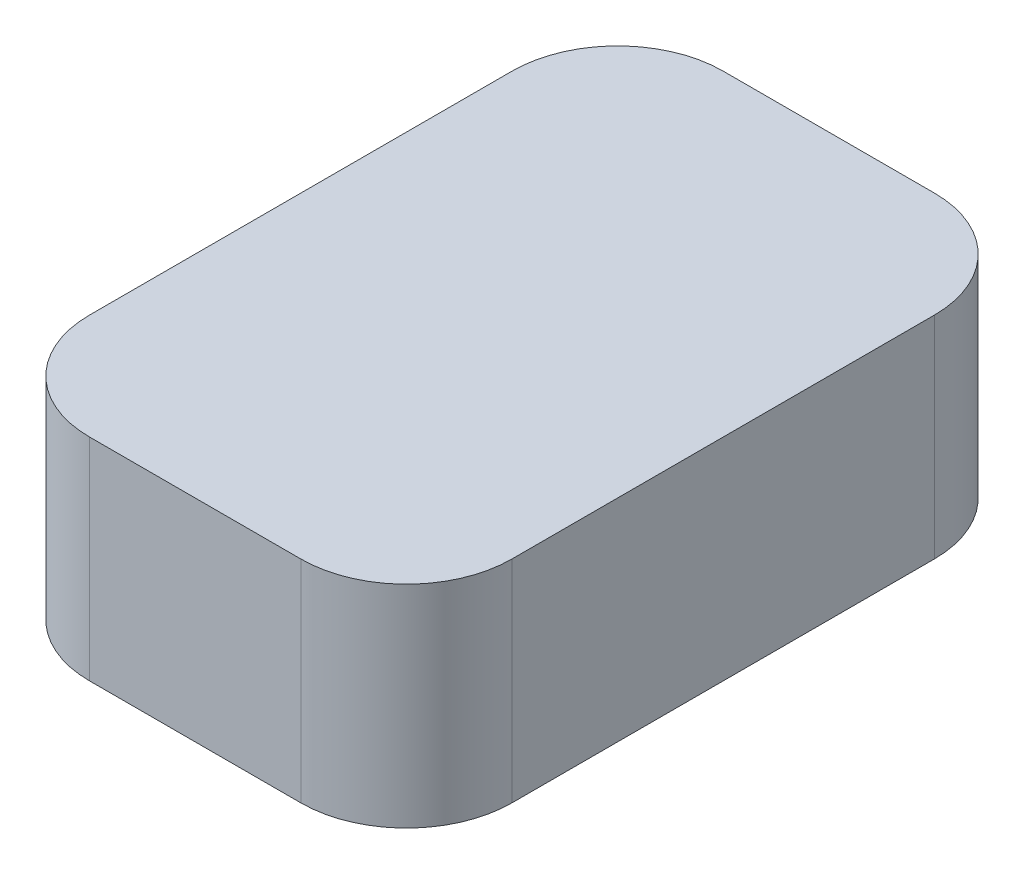
ISO-10303-21;
HEADER;
FILE_DESCRIPTION(('STEP AP214'),'2;1');
FILE_NAME('part.step','',(''),(''),'','','');
FILE_SCHEMA(('AUTOMOTIVE_DESIGN { 1 0 10303 214 1 1 1 1 }'));
ENDSEC;
DATA;
#1=APPLICATION_CONTEXT('core data for automotive mechanical design processes');
#2=APPLICATION_PROTOCOL_DEFINITION('international standard','automotive_design',2000,#1);
#3=PRODUCT_CONTEXT('',#1,'mechanical');
#4=PRODUCT('Part','Part','',(#3));
#5=PRODUCT_RELATED_PRODUCT_CATEGORY('part','',(#4));
#6=PRODUCT_DEFINITION_FORMATION('','',#4);
#7=PRODUCT_DEFINITION_CONTEXT('part definition',#1,'design');
#8=PRODUCT_DEFINITION('design','',#6,#7);
#9=PRODUCT_DEFINITION_SHAPE('','',#8);
#10=(LENGTH_UNIT() NAMED_UNIT(*) SI_UNIT(.MILLI.,.METRE.));
#11=(NAMED_UNIT(*) PLANE_ANGLE_UNIT() SI_UNIT($,.RADIAN.));
#12=(NAMED_UNIT(*) SI_UNIT($,.STERADIAN.) SOLID_ANGLE_UNIT());
#13=UNCERTAINTY_MEASURE_WITH_UNIT(LENGTH_MEASURE(1.E-05),#10,'distance_accuracy_value','');
#14=(GEOMETRIC_REPRESENTATION_CONTEXT(3) GLOBAL_UNCERTAINTY_ASSIGNED_CONTEXT((#13)) GLOBAL_UNIT_ASSIGNED_CONTEXT((#10,
#11,#12)) REPRESENTATION_CONTEXT('',''));
#15=CARTESIAN_POINT('',(0.,0.,0.));
#16=DIRECTION('',(0.,0.,1.));
#17=DIRECTION('',(1.,0.,0.));
#18=AXIS2_PLACEMENT_3D('',#15,#16,#17);
#19=CARTESIAN_POINT('',(10.,-10.,15.));
#20=DIRECTION('',(1.,0.,0.));
#21=DIRECTION('',(0.,0.,-1.));
#22=AXIS2_PLACEMENT_3D('',#19,#20,#21);
#23=PLANE('',#22);
#24=DIRECTION('',(0.,0.,-1.));
#25=VECTOR('',#24,1.);
#26=CARTESIAN_POINT('',(10.,-10.,15.));
#27=LINE('',#26,#25);
#28=CARTESIAN_POINT('',(10.,-10.,10.));
#29=VERTEX_POINT('',#28);
#30=CARTESIAN_POINT('',(10.,-10.,-10.));
#31=VERTEX_POINT('',#30);
#32=EDGE_CURVE('E167',#29,#31,#27,.T.);
#33=ORIENTED_EDGE('',*,*,#32,.T.);
#34=DIRECTION('',(0.,1.,0.));
#35=VECTOR('',#34,1.);
#36=CARTESIAN_POINT('',(10.,-10.,-10.));
#37=LINE('',#36,#35);
#38=CARTESIAN_POINT('',(10.,0.,-10.));
#39=VERTEX_POINT('',#38);
#40=EDGE_CURVE('E115',#31,#39,#37,.T.);
#41=ORIENTED_EDGE('',*,*,#40,.T.);
#42=DIRECTION('',(0.,0.,-1.));
#43=VECTOR('',#42,1.);
#44=CARTESIAN_POINT('',(10.,0.,15.));
#45=LINE('',#44,#43);
#46=CARTESIAN_POINT('',(10.,0.,10.));
#47=VERTEX_POINT('',#46);
#48=EDGE_CURVE('E107',#47,#39,#45,.T.);
#49=ORIENTED_EDGE('',*,*,#48,.F.);
#50=DIRECTION('',(0.,1.,0.));
#51=VECTOR('',#50,1.);
#52=CARTESIAN_POINT('',(10.,-10.,10.));
#53=LINE('',#52,#51);
#54=EDGE_CURVE('E120',#47,#29,#53,.F.);
#55=ORIENTED_EDGE('',*,*,#54,.T.);
#56=EDGE_LOOP('',(#33,#41,#49,#55));
#57=FACE_BOUND('',#56,.T.);
#58=ADVANCED_FACE('F38',(#57),#23,.T.);
#59=CARTESIAN_POINT('',(-10.,-10.,15.));
#60=DIRECTION('',(0.,0.,1.));
#61=DIRECTION('',(1.,0.,0.));
#62=AXIS2_PLACEMENT_3D('',#59,#60,#61);
#63=PLANE('',#62);
#64=DIRECTION('',(1.,0.,0.));
#65=VECTOR('',#64,1.);
#66=CARTESIAN_POINT('',(-10.,0.,15.));
#67=LINE('',#66,#65);
#68=CARTESIAN_POINT('',(-5.,0.,15.));
#69=VERTEX_POINT('',#68);
#70=CARTESIAN_POINT('',(5.,0.,15.));
#71=VERTEX_POINT('',#70);
#72=EDGE_CURVE('E109',#69,#71,#67,.T.);
#73=ORIENTED_EDGE('',*,*,#72,.F.);
#74=DIRECTION('',(0.,1.,0.));
#75=VECTOR('',#74,1.);
#76=CARTESIAN_POINT('',(-5.,-10.,15.));
#77=LINE('',#76,#75);
#78=CARTESIAN_POINT('',(-5.,-10.,15.));
#79=VERTEX_POINT('',#78);
#80=EDGE_CURVE('E11',#69,#79,#77,.F.);
#81=ORIENTED_EDGE('',*,*,#80,.T.);
#82=DIRECTION('',(1.,0.,0.));
#83=VECTOR('',#82,1.);
#84=CARTESIAN_POINT('',(-10.,-10.,15.));
#85=LINE('',#84,#83);
#86=CARTESIAN_POINT('',(5.,-10.,15.));
#87=VERTEX_POINT('',#86);
#88=EDGE_CURVE('E127',#79,#87,#85,.T.);
#89=ORIENTED_EDGE('',*,*,#88,.T.);
#90=DIRECTION('',(0.,1.,0.));
#91=VECTOR('',#90,1.);
#92=CARTESIAN_POINT('',(5.,-10.,15.));
#93=LINE('',#92,#91);
#94=EDGE_CURVE('E46',#87,#71,#93,.T.);
#95=ORIENTED_EDGE('',*,*,#94,.T.);
#96=EDGE_LOOP('',(#73,#81,#89,#95));
#97=FACE_BOUND('',#96,.T.);
#98=ADVANCED_FACE('F156',(#97),#63,.T.);
#99=CARTESIAN_POINT('',(-10.,-10.,15.));
#100=DIRECTION('',(-1.,0.,0.));
#101=DIRECTION('',(0.,0.,1.));
#102=AXIS2_PLACEMENT_3D('',#99,#100,#101);
#103=PLANE('',#102);
#104=DIRECTION('',(0.,0.,1.));
#105=VECTOR('',#104,1.);
#106=CARTESIAN_POINT('',(-10.,0.,15.));
#107=LINE('',#106,#105);
#108=CARTESIAN_POINT('',(-10.,0.,-10.));
#109=VERTEX_POINT('',#108);
#110=CARTESIAN_POINT('',(-10.,0.,10.));
#111=VERTEX_POINT('',#110);
#112=EDGE_CURVE('E165',#109,#111,#107,.T.);
#113=ORIENTED_EDGE('',*,*,#112,.F.);
#114=DIRECTION('',(0.,1.,0.));
#115=VECTOR('',#114,1.);
#116=CARTESIAN_POINT('',(-10.,-10.,-10.));
#117=LINE('',#116,#115);
#118=CARTESIAN_POINT('',(-10.,-10.,-10.));
#119=VERTEX_POINT('',#118);
#120=EDGE_CURVE('E60',#109,#119,#117,.F.);
#121=ORIENTED_EDGE('',*,*,#120,.T.);
#122=DIRECTION('',(0.,0.,1.));
#123=VECTOR('',#122,1.);
#124=CARTESIAN_POINT('',(-10.,-10.,15.));
#125=LINE('',#124,#123);
#126=CARTESIAN_POINT('',(-10.,-10.,10.));
#127=VERTEX_POINT('',#126);
#128=EDGE_CURVE('E131',#119,#127,#125,.T.);
#129=ORIENTED_EDGE('',*,*,#128,.T.);
#130=DIRECTION('',(0.,1.,0.));
#131=VECTOR('',#130,1.);
#132=CARTESIAN_POINT('',(-10.,-10.,10.));
#133=LINE('',#132,#131);
#134=EDGE_CURVE('E152',#127,#111,#133,.T.);
#135=ORIENTED_EDGE('',*,*,#134,.T.);
#136=EDGE_LOOP('',(#113,#121,#129,#135));
#137=FACE_BOUND('',#136,.T.);
#138=ADVANCED_FACE('F164',(#137),#103,.T.);
#139=CARTESIAN_POINT('',(-10.,-10.,-15.));
#140=DIRECTION('',(0.,0.,-1.));
#141=DIRECTION('',(-1.,0.,0.));
#142=AXIS2_PLACEMENT_3D('',#139,#140,#141);
#143=PLANE('',#142);
#144=DIRECTION('',(-1.,0.,0.));
#145=VECTOR('',#144,1.);
#146=CARTESIAN_POINT('',(-10.,0.,-15.));
#147=LINE('',#146,#145);
#148=CARTESIAN_POINT('',(5.,0.,-15.));
#149=VERTEX_POINT('',#148);
#150=CARTESIAN_POINT('',(-5.,0.,-15.));
#151=VERTEX_POINT('',#150);
#152=EDGE_CURVE('E123',#149,#151,#147,.T.);
#153=ORIENTED_EDGE('',*,*,#152,.F.);
#154=DIRECTION('',(0.,1.,0.));
#155=VECTOR('',#154,1.);
#156=CARTESIAN_POINT('',(5.,-10.,-15.));
#157=LINE('',#156,#155);
#158=CARTESIAN_POINT('',(5.,-10.,-15.));
#159=VERTEX_POINT('',#158);
#160=EDGE_CURVE('E144',#149,#159,#157,.F.);
#161=ORIENTED_EDGE('',*,*,#160,.T.);
#162=DIRECTION('',(-1.,0.,0.));
#163=VECTOR('',#162,1.);
#164=CARTESIAN_POINT('',(-10.,-10.,-15.));
#165=LINE('',#164,#163);
#166=CARTESIAN_POINT('',(-5.,-10.,-15.));
#167=VERTEX_POINT('',#166);
#168=EDGE_CURVE('E171',#159,#167,#165,.T.);
#169=ORIENTED_EDGE('',*,*,#168,.T.);
#170=DIRECTION('',(0.,1.,0.));
#171=VECTOR('',#170,1.);
#172=CARTESIAN_POINT('',(-5.,-10.,-15.));
#173=LINE('',#172,#171);
#174=EDGE_CURVE('E141',#167,#151,#173,.T.);
#175=ORIENTED_EDGE('',*,*,#174,.T.);
#176=EDGE_LOOP('',(#153,#161,#169,#175));
#177=FACE_BOUND('',#176,.T.);
#178=ADVANCED_FACE('F180',(#177),#143,.T.);
#179=CARTESIAN_POINT('',(0.,-10.,0.));
#180=DIRECTION('',(0.,-1.,0.));
#181=DIRECTION('',(0.,0.,-1.));
#182=AXIS2_PLACEMENT_3D('',#179,#180,#181);
#183=PLANE('',#182);
#184=ORIENTED_EDGE('',*,*,#168,.F.);
#185=CARTESIAN_POINT('',(5.,-10.,-10.));
#186=DIRECTION('',(0.,-1.,0.));
#187=DIRECTION('',(0.,0.,-1.));
#188=AXIS2_PLACEMENT_3D('',#185,#186,#187);
#189=CIRCLE('',#188,5.);
#190=EDGE_CURVE('E150',#159,#31,#189,.T.);
#191=ORIENTED_EDGE('',*,*,#190,.T.);
#192=ORIENTED_EDGE('',*,*,#32,.F.);
#193=CARTESIAN_POINT('',(5.,-10.,10.));
#194=DIRECTION('',(0.,-1.,0.));
#195=DIRECTION('',(0.,0.,-1.));
#196=AXIS2_PLACEMENT_3D('',#193,#194,#195);
#197=CIRCLE('',#196,5.);
#198=EDGE_CURVE('E126',#29,#87,#197,.T.);
#199=ORIENTED_EDGE('',*,*,#198,.T.);
#200=ORIENTED_EDGE('',*,*,#88,.F.);
#201=CARTESIAN_POINT('',(-5.,-10.,10.));
#202=DIRECTION('',(0.,-1.,0.));
#203=DIRECTION('',(0.,0.,-1.));
#204=AXIS2_PLACEMENT_3D('',#201,#202,#203);
#205=CIRCLE('',#204,5.);
#206=EDGE_CURVE('E53',#79,#127,#205,.T.);
#207=ORIENTED_EDGE('',*,*,#206,.T.);
#208=ORIENTED_EDGE('',*,*,#128,.F.);
#209=CARTESIAN_POINT('',(-5.,-10.,-10.));
#210=DIRECTION('',(0.,-1.,0.));
#211=DIRECTION('',(0.,0.,-1.));
#212=AXIS2_PLACEMENT_3D('',#209,#210,#211);
#213=CIRCLE('',#212,5.);
#214=EDGE_CURVE('E148',#119,#167,#213,.T.);
#215=ORIENTED_EDGE('',*,*,#214,.T.);
#216=EDGE_LOOP('',(#184,#191,#192,#199,#200,#207,#208,#215));
#217=FACE_BOUND('',#216,.T.);
#218=ADVANCED_FACE('F159',(#217),#183,.T.);
#219=CARTESIAN_POINT('',(0.,0.,0.));
#220=DIRECTION('',(0.,-1.,0.));
#221=DIRECTION('',(0.,0.,-1.));
#222=AXIS2_PLACEMENT_3D('',#219,#220,#221);
#223=PLANE('',#222);
#224=ORIENTED_EDGE('',*,*,#48,.T.);
#225=CARTESIAN_POINT('',(5.,0.,-10.));
#226=DIRECTION('',(0.,-1.,0.));
#227=DIRECTION('',(0.,0.,-1.));
#228=AXIS2_PLACEMENT_3D('',#225,#226,#227);
#229=CIRCLE('',#228,5.);
#230=EDGE_CURVE('E139',#39,#149,#229,.F.);
#231=ORIENTED_EDGE('',*,*,#230,.T.);
#232=ORIENTED_EDGE('',*,*,#152,.T.);
#233=CARTESIAN_POINT('',(-5.,0.,-10.));
#234=DIRECTION('',(0.,-1.,0.));
#235=DIRECTION('',(0.,0.,-1.));
#236=AXIS2_PLACEMENT_3D('',#233,#234,#235);
#237=CIRCLE('',#236,5.);
#238=EDGE_CURVE('E137',#151,#109,#237,.F.);
#239=ORIENTED_EDGE('',*,*,#238,.T.);
#240=ORIENTED_EDGE('',*,*,#112,.T.);
#241=CARTESIAN_POINT('',(-5.,0.,10.));
#242=DIRECTION('',(0.,-1.,0.));
#243=DIRECTION('',(0.,0.,-1.));
#244=AXIS2_PLACEMENT_3D('',#241,#242,#243);
#245=CIRCLE('',#244,5.);
#246=EDGE_CURVE('E114',#111,#69,#245,.F.);
#247=ORIENTED_EDGE('',*,*,#246,.T.);
#248=ORIENTED_EDGE('',*,*,#72,.T.);
#249=CARTESIAN_POINT('',(5.,0.,10.));
#250=DIRECTION('',(0.,-1.,0.));
#251=DIRECTION('',(0.,0.,-1.));
#252=AXIS2_PLACEMENT_3D('',#249,#250,#251);
#253=CIRCLE('',#252,5.);
#254=EDGE_CURVE('E104',#71,#47,#253,.F.);
#255=ORIENTED_EDGE('',*,*,#254,.T.);
#256=EDGE_LOOP('',(#224,#231,#232,#239,#240,#247,#248,#255));
#257=FACE_BOUND('',#256,.T.);
#258=ADVANCED_FACE('F106',(#257),#223,.F.);
#259=CARTESIAN_POINT('',(5.,-10.,-10.));
#260=DIRECTION('',(0.,1.,0.));
#261=DIRECTION('',(0.,0.,1.));
#262=AXIS2_PLACEMENT_3D('',#259,#260,#261);
#263=CYLINDRICAL_SURFACE('',#262,5.);
#264=ORIENTED_EDGE('',*,*,#190,.F.);
#265=ORIENTED_EDGE('',*,*,#160,.F.);
#266=ORIENTED_EDGE('',*,*,#230,.F.);
#267=ORIENTED_EDGE('',*,*,#40,.F.);
#268=EDGE_LOOP('',(#264,#265,#266,#267));
#269=FACE_BOUND('',#268,.T.);
#270=ADVANCED_FACE('F176',(#269),#263,.T.);
#271=CARTESIAN_POINT('',(-5.,-10.,-10.));
#272=DIRECTION('',(0.,1.,0.));
#273=DIRECTION('',(0.,0.,1.));
#274=AXIS2_PLACEMENT_3D('',#271,#272,#273);
#275=CYLINDRICAL_SURFACE('',#274,5.);
#276=ORIENTED_EDGE('',*,*,#214,.F.);
#277=ORIENTED_EDGE('',*,*,#120,.F.);
#278=ORIENTED_EDGE('',*,*,#238,.F.);
#279=ORIENTED_EDGE('',*,*,#174,.F.);
#280=EDGE_LOOP('',(#276,#277,#278,#279));
#281=FACE_BOUND('',#280,.T.);
#282=ADVANCED_FACE('F184',(#281),#275,.T.);
#283=CARTESIAN_POINT('',(-5.,-10.,10.));
#284=DIRECTION('',(0.,1.,0.));
#285=DIRECTION('',(0.,0.,1.));
#286=AXIS2_PLACEMENT_3D('',#283,#284,#285);
#287=CYLINDRICAL_SURFACE('',#286,5.);
#288=ORIENTED_EDGE('',*,*,#206,.F.);
#289=ORIENTED_EDGE('',*,*,#80,.F.);
#290=ORIENTED_EDGE('',*,*,#246,.F.);
#291=ORIENTED_EDGE('',*,*,#134,.F.);
#292=EDGE_LOOP('',(#288,#289,#290,#291));
#293=FACE_BOUND('',#292,.T.);
#294=ADVANCED_FACE('F162',(#293),#287,.T.);
#295=CARTESIAN_POINT('',(5.,-10.,10.));
#296=DIRECTION('',(0.,1.,0.));
#297=DIRECTION('',(0.,0.,1.));
#298=AXIS2_PLACEMENT_3D('',#295,#296,#297);
#299=CYLINDRICAL_SURFACE('',#298,5.);
#300=ORIENTED_EDGE('',*,*,#198,.F.);
#301=ORIENTED_EDGE('',*,*,#54,.F.);
#302=ORIENTED_EDGE('',*,*,#254,.F.);
#303=ORIENTED_EDGE('',*,*,#94,.F.);
#304=EDGE_LOOP('',(#300,#301,#302,#303));
#305=FACE_BOUND('',#304,.T.);
#306=ADVANCED_FACE('F40',(#305),#299,.T.);
#307=CLOSED_SHELL('',(#58,#98,#138,#178,#218,#258,#270,#282,#294,#306));
#308=MANIFOLD_SOLID_BREP('B2',#307);
#309=ADVANCED_BREP_SHAPE_REPRESENTATION('',(#18,#308),#14);
#310=SHAPE_DEFINITION_REPRESENTATION(#9,#309);
ENDSEC;
END-ISO-10303-21;
